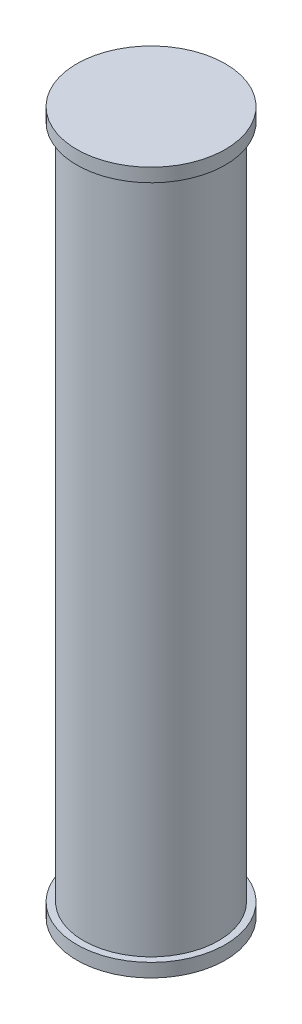
ISO-10303-21;
HEADER;
FILE_DESCRIPTION(('STEP AP214'),'2;1');
FILE_NAME('part.step','',(''),(''),'','','');
FILE_SCHEMA(('AUTOMOTIVE_DESIGN { 1 0 10303 214 1 1 1 1 }'));
ENDSEC;
DATA;
#1=APPLICATION_CONTEXT('core data for automotive mechanical design processes');
#2=APPLICATION_PROTOCOL_DEFINITION('international standard','automotive_design',2000,#1);
#3=PRODUCT_CONTEXT('',#1,'mechanical');
#4=PRODUCT('Part','Part','',(#3));
#5=PRODUCT_RELATED_PRODUCT_CATEGORY('part','',(#4));
#6=PRODUCT_DEFINITION_FORMATION('','',#4);
#7=PRODUCT_DEFINITION_CONTEXT('part definition',#1,'design');
#8=PRODUCT_DEFINITION('design','',#6,#7);
#9=PRODUCT_DEFINITION_SHAPE('','',#8);
#10=(LENGTH_UNIT() NAMED_UNIT(*) SI_UNIT(.MILLI.,.METRE.));
#11=(NAMED_UNIT(*) PLANE_ANGLE_UNIT() SI_UNIT($,.RADIAN.));
#12=(NAMED_UNIT(*) SI_UNIT($,.STERADIAN.) SOLID_ANGLE_UNIT());
#13=UNCERTAINTY_MEASURE_WITH_UNIT(LENGTH_MEASURE(1.E-05),#10,'distance_accuracy_value','');
#14=(GEOMETRIC_REPRESENTATION_CONTEXT(3) GLOBAL_UNCERTAINTY_ASSIGNED_CONTEXT((#13)) GLOBAL_UNIT_ASSIGNED_CONTEXT((#10,
#11,#12)) REPRESENTATION_CONTEXT('',''));
#15=CARTESIAN_POINT('',(0.,0.,0.));
#16=DIRECTION('',(0.,0.,1.));
#17=DIRECTION('',(1.,0.,0.));
#18=AXIS2_PLACEMENT_3D('',#15,#16,#17);
#19=CARTESIAN_POINT('',(0.,6.35,0.));
#20=DIRECTION('',(0.,-1.,0.));
#21=DIRECTION('',(0.,0.,-1.));
#22=AXIS2_PLACEMENT_3D('',#19,#20,#21);
#23=CYLINDRICAL_SURFACE('',#22,1.27);
#24=CARTESIAN_POINT('',(0.,6.35,0.));
#25=DIRECTION('',(0.,1.,0.));
#26=DIRECTION('',(0.,0.,1.));
#27=AXIS2_PLACEMENT_3D('',#24,#25,#26);
#28=CIRCLE('',#27,1.27);
#29=CARTESIAN_POINT('',(0.,6.35,1.27));
#30=VERTEX_POINT('',#29);
#31=EDGE_CURVE('E10',#30,#30,#28,.T.);
#32=ORIENTED_EDGE('',*,*,#31,.F.);
#33=EDGE_LOOP('',(#32));
#34=FACE_BOUND('',#33,.T.);
#35=CARTESIAN_POINT('',(0.,-6.35,0.));
#36=DIRECTION('',(0.,1.,0.));
#37=DIRECTION('',(0.,0.,1.));
#38=AXIS2_PLACEMENT_3D('',#35,#36,#37);
#39=CIRCLE('',#38,1.27);
#40=CARTESIAN_POINT('',(0.,-6.35,1.27));
#41=VERTEX_POINT('',#40);
#42=EDGE_CURVE('E40',#41,#41,#39,.T.);
#43=ORIENTED_EDGE('',*,*,#42,.T.);
#44=EDGE_LOOP('',(#43));
#45=FACE_BOUND('',#44,.T.);
#46=ADVANCED_FACE('F37',(#34,#45),#23,.T.);
#47=CARTESIAN_POINT('',(0.,-6.604,0.));
#48=DIRECTION('',(0.,1.,0.));
#49=DIRECTION('',(0.,0.,1.));
#50=AXIS2_PLACEMENT_3D('',#47,#48,#49);
#51=CYLINDRICAL_SURFACE('',#50,1.397);
#52=CARTESIAN_POINT('',(0.,-6.604,0.));
#53=DIRECTION('',(0.,-1.,0.));
#54=DIRECTION('',(0.,0.,-1.));
#55=AXIS2_PLACEMENT_3D('',#52,#53,#54);
#56=CIRCLE('',#55,1.397);
#57=CARTESIAN_POINT('',(0.,-6.604,-1.397));
#58=VERTEX_POINT('',#57);
#59=EDGE_CURVE('E49',#58,#58,#56,.T.);
#60=ORIENTED_EDGE('',*,*,#59,.F.);
#61=EDGE_LOOP('',(#60));
#62=FACE_BOUND('',#61,.T.);
#63=CARTESIAN_POINT('',(0.,-6.35,0.));
#64=DIRECTION('',(0.,-1.,0.));
#65=DIRECTION('',(0.,0.,-1.));
#66=AXIS2_PLACEMENT_3D('',#63,#64,#65);
#67=CIRCLE('',#66,1.397);
#68=CARTESIAN_POINT('',(0.,-6.35,-1.397));
#69=VERTEX_POINT('',#68);
#70=EDGE_CURVE('E51',#69,#69,#67,.T.);
#71=ORIENTED_EDGE('',*,*,#70,.T.);
#72=EDGE_LOOP('',(#71));
#73=FACE_BOUND('',#72,.T.);
#74=ADVANCED_FACE('F82',(#62,#73),#51,.T.);
#75=CARTESIAN_POINT('',(0.,-6.604,0.));
#76=DIRECTION('',(0.,-1.,0.));
#77=DIRECTION('',(0.,0.,-1.));
#78=AXIS2_PLACEMENT_3D('',#75,#76,#77);
#79=PLANE('',#78);
#80=ORIENTED_EDGE('',*,*,#59,.T.);
#81=EDGE_LOOP('',(#80));
#82=FACE_BOUND('',#81,.T.);
#83=ADVANCED_FACE('F87',(#82),#79,.T.);
#84=CARTESIAN_POINT('',(0.,-6.35,0.));
#85=DIRECTION('',(0.,-1.,0.));
#86=DIRECTION('',(0.,0.,-1.));
#87=AXIS2_PLACEMENT_3D('',#84,#85,#86);
#88=PLANE('',#87);
#89=ORIENTED_EDGE('',*,*,#42,.F.);
#90=EDGE_LOOP('',(#89));
#91=FACE_BOUND('',#90,.T.);
#92=ORIENTED_EDGE('',*,*,#70,.F.);
#93=EDGE_LOOP('',(#92));
#94=FACE_BOUND('',#93,.T.);
#95=ADVANCED_FACE('F79',(#91,#94),#88,.F.);
#96=CARTESIAN_POINT('',(0.,6.604,0.));
#97=DIRECTION('',(0.,-1.,0.));
#98=DIRECTION('',(0.,0.,-1.));
#99=AXIS2_PLACEMENT_3D('',#96,#97,#98);
#100=CYLINDRICAL_SURFACE('',#99,1.397);
#101=CARTESIAN_POINT('',(0.,6.604,0.));
#102=DIRECTION('',(0.,-1.,0.));
#103=DIRECTION('',(0.,0.,-1.));
#104=AXIS2_PLACEMENT_3D('',#101,#102,#103);
#105=CIRCLE('',#104,1.397);
#106=CARTESIAN_POINT('',(0.,6.604,-1.397));
#107=VERTEX_POINT('',#106);
#108=EDGE_CURVE('E55',#107,#107,#105,.T.);
#109=ORIENTED_EDGE('',*,*,#108,.T.);
#110=EDGE_LOOP('',(#109));
#111=FACE_BOUND('',#110,.T.);
#112=CARTESIAN_POINT('',(0.,6.35,0.));
#113=DIRECTION('',(0.,-1.,0.));
#114=DIRECTION('',(0.,0.,-1.));
#115=AXIS2_PLACEMENT_3D('',#112,#113,#114);
#116=CIRCLE('',#115,1.397);
#117=CARTESIAN_POINT('',(0.,6.35,-1.397));
#118=VERTEX_POINT('',#117);
#119=EDGE_CURVE('E59',#118,#118,#116,.T.);
#120=ORIENTED_EDGE('',*,*,#119,.F.);
#121=EDGE_LOOP('',(#120));
#122=FACE_BOUND('',#121,.T.);
#123=ADVANCED_FACE('F67',(#111,#122),#100,.T.);
#124=CARTESIAN_POINT('',(0.,6.604,0.));
#125=DIRECTION('',(0.,1.,0.));
#126=DIRECTION('',(0.,0.,-1.));
#127=AXIS2_PLACEMENT_3D('',#124,#125,#126);
#128=PLANE('',#127);
#129=ORIENTED_EDGE('',*,*,#108,.F.);
#130=EDGE_LOOP('',(#129));
#131=FACE_BOUND('',#130,.T.);
#132=ADVANCED_FACE('F70',(#131),#128,.T.);
#133=CARTESIAN_POINT('',(0.,6.35,0.));
#134=DIRECTION('',(0.,1.,0.));
#135=DIRECTION('',(0.,0.,-1.));
#136=AXIS2_PLACEMENT_3D('',#133,#134,#135);
#137=PLANE('',#136);
#138=ORIENTED_EDGE('',*,*,#31,.T.);
#139=EDGE_LOOP('',(#138));
#140=FACE_BOUND('',#139,.T.);
#141=ORIENTED_EDGE('',*,*,#119,.T.);
#142=EDGE_LOOP('',(#141));
#143=FACE_BOUND('',#142,.T.);
#144=ADVANCED_FACE('F72',(#140,#143),#137,.F.);
#145=CLOSED_SHELL('',(#46,#74,#83,#95,#123,#132,#144));
#146=MANIFOLD_SOLID_BREP('B2',#145);
#147=ADVANCED_BREP_SHAPE_REPRESENTATION('',(#18,#146),#14);
#148=SHAPE_DEFINITION_REPRESENTATION(#9,#147);
ENDSEC;
END-ISO-10303-21;
